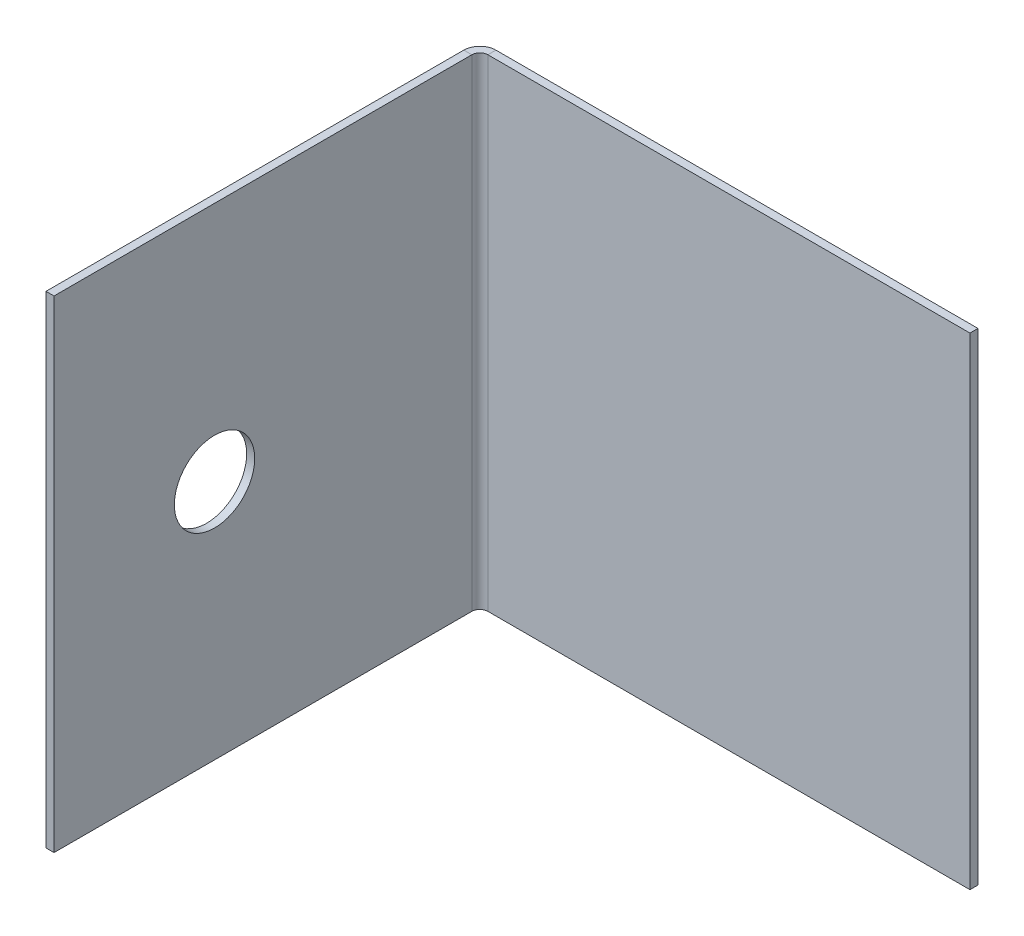
ISO-10303-21;
HEADER;
FILE_DESCRIPTION(('STEP AP214'),'2;1');
FILE_NAME('part.step','',(''),(''),'','','');
FILE_SCHEMA(('AUTOMOTIVE_DESIGN { 1 0 10303 214 1 1 1 1 }'));
ENDSEC;
DATA;
#1=APPLICATION_CONTEXT('core data for automotive mechanical design processes');
#2=APPLICATION_PROTOCOL_DEFINITION('international standard','automotive_design',2000,#1);
#3=PRODUCT_CONTEXT('',#1,'mechanical');
#4=PRODUCT('Part','Part','',(#3));
#5=PRODUCT_RELATED_PRODUCT_CATEGORY('part','',(#4));
#6=PRODUCT_DEFINITION_FORMATION('','',#4);
#7=PRODUCT_DEFINITION_CONTEXT('part definition',#1,'design');
#8=PRODUCT_DEFINITION('design','',#6,#7);
#9=PRODUCT_DEFINITION_SHAPE('','',#8);
#10=(LENGTH_UNIT() NAMED_UNIT(*) SI_UNIT(.MILLI.,.METRE.));
#11=(NAMED_UNIT(*) PLANE_ANGLE_UNIT() SI_UNIT($,.RADIAN.));
#12=(NAMED_UNIT(*) SI_UNIT($,.STERADIAN.) SOLID_ANGLE_UNIT());
#13=UNCERTAINTY_MEASURE_WITH_UNIT(LENGTH_MEASURE(1.E-05),#10,'distance_accuracy_value','');
#14=(GEOMETRIC_REPRESENTATION_CONTEXT(3) GLOBAL_UNCERTAINTY_ASSIGNED_CONTEXT((#13)) GLOBAL_UNIT_ASSIGNED_CONTEXT((#10,
#11,#12)) REPRESENTATION_CONTEXT('',''));
#15=CARTESIAN_POINT('',(0.,0.,0.));
#16=DIRECTION('',(0.,0.,1.));
#17=DIRECTION('',(1.,0.,0.));
#18=AXIS2_PLACEMENT_3D('',#15,#16,#17);
#19=CARTESIAN_POINT('',(15.,15.,-0.5));
#20=DIRECTION('',(1.,0.,0.));
#21=DIRECTION('',(0.,1.,0.));
#22=AXIS2_PLACEMENT_3D('',#19,#20,#21);
#23=PLANE('',#22);
#24=DIRECTION('',(0.,1.,0.));
#25=VECTOR('',#24,1.);
#26=CARTESIAN_POINT('',(15.,15.,0.));
#27=LINE('',#26,#25);
#28=CARTESIAN_POINT('',(15.,-15.,0.));
#29=VERTEX_POINT('',#28);
#30=CARTESIAN_POINT('',(15.,15.,0.));
#31=VERTEX_POINT('',#30);
#32=EDGE_CURVE('E177',#29,#31,#27,.T.);
#33=ORIENTED_EDGE('',*,*,#32,.F.);
#34=DIRECTION('',(0.,0.,1.));
#35=VECTOR('',#34,1.);
#36=CARTESIAN_POINT('',(15.,-15.,-0.5));
#37=LINE('',#36,#35);
#38=CARTESIAN_POINT('',(15.,-15.,-0.5));
#39=VERTEX_POINT('',#38);
#40=EDGE_CURVE('E13',#39,#29,#37,.T.);
#41=ORIENTED_EDGE('',*,*,#40,.F.);
#42=DIRECTION('',(0.,1.,0.));
#43=VECTOR('',#42,1.);
#44=CARTESIAN_POINT('',(15.,15.,-0.5));
#45=LINE('',#44,#43);
#46=CARTESIAN_POINT('',(15.,15.,-0.5));
#47=VERTEX_POINT('',#46);
#48=EDGE_CURVE('E187',#39,#47,#45,.T.);
#49=ORIENTED_EDGE('',*,*,#48,.T.);
#50=DIRECTION('',(0.,0.,1.));
#51=VECTOR('',#50,1.);
#52=CARTESIAN_POINT('',(15.,15.,-0.5));
#53=LINE('',#52,#51);
#54=EDGE_CURVE('E61',#47,#31,#53,.T.);
#55=ORIENTED_EDGE('',*,*,#54,.T.);
#56=EDGE_LOOP('',(#33,#41,#49,#55));
#57=FACE_BOUND('',#56,.T.);
#58=ADVANCED_FACE('F58',(#57),#23,.T.);
#59=CARTESIAN_POINT('',(-15.,-15.,-0.5));
#60=DIRECTION('',(0.,-1.,0.));
#61=DIRECTION('',(0.,0.,-1.));
#62=AXIS2_PLACEMENT_3D('',#59,#60,#61);
#63=PLANE('',#62);
#64=DIRECTION('',(1.,0.,0.));
#65=VECTOR('',#64,1.);
#66=CARTESIAN_POINT('',(-15.,-15.,0.));
#67=LINE('',#66,#65);
#68=CARTESIAN_POINT('',(-15.,-15.,0.));
#69=VERTEX_POINT('',#68);
#70=EDGE_CURVE('E190',#69,#29,#67,.T.);
#71=ORIENTED_EDGE('',*,*,#70,.F.);
#72=DIRECTION('',(0.,0.,1.));
#73=VECTOR('',#72,1.);
#74=CARTESIAN_POINT('',(-15.,-15.,-0.5));
#75=LINE('',#74,#73);
#76=CARTESIAN_POINT('',(-15.,-15.,-0.500000000000001));
#77=VERTEX_POINT('',#76);
#78=EDGE_CURVE('E67',#77,#69,#75,.T.);
#79=ORIENTED_EDGE('',*,*,#78,.F.);
#80=DIRECTION('',(1.,0.,0.));
#81=VECTOR('',#80,1.);
#82=CARTESIAN_POINT('',(-15.,-15.,-0.5));
#83=LINE('',#82,#81);
#84=EDGE_CURVE('E195',#77,#39,#83,.T.);
#85=ORIENTED_EDGE('',*,*,#84,.T.);
#86=ORIENTED_EDGE('',*,*,#40,.T.);
#87=EDGE_LOOP('',(#71,#79,#85,#86));
#88=FACE_BOUND('',#87,.T.);
#89=ADVANCED_FACE('F209',(#88),#63,.T.);
#90=CARTESIAN_POINT('',(-15.,15.,-0.5));
#91=DIRECTION('',(0.,1.,0.));
#92=DIRECTION('',(0.,0.,1.));
#93=AXIS2_PLACEMENT_3D('',#90,#91,#92);
#94=PLANE('',#93);
#95=DIRECTION('',(-1.,0.,0.));
#96=VECTOR('',#95,1.);
#97=CARTESIAN_POINT('',(-15.,15.,0.));
#98=LINE('',#97,#96);
#99=CARTESIAN_POINT('',(-15.,15.,0.));
#100=VERTEX_POINT('',#99);
#101=EDGE_CURVE('E199',#31,#100,#98,.T.);
#102=ORIENTED_EDGE('',*,*,#101,.F.);
#103=ORIENTED_EDGE('',*,*,#54,.F.);
#104=DIRECTION('',(-1.,0.,0.));
#105=VECTOR('',#104,1.);
#106=CARTESIAN_POINT('',(-15.,15.,-0.5));
#107=LINE('',#106,#105);
#108=CARTESIAN_POINT('',(-15.,15.,-0.5));
#109=VERTEX_POINT('',#108);
#110=EDGE_CURVE('E189',#47,#109,#107,.T.);
#111=ORIENTED_EDGE('',*,*,#110,.T.);
#112=DIRECTION('',(0.,0.,1.));
#113=VECTOR('',#112,1.);
#114=CARTESIAN_POINT('',(-15.,15.,-0.5));
#115=LINE('',#114,#113);
#116=EDGE_CURVE('E204',#109,#100,#115,.T.);
#117=ORIENTED_EDGE('',*,*,#116,.T.);
#118=EDGE_LOOP('',(#102,#103,#111,#117));
#119=FACE_BOUND('',#118,.T.);
#120=ADVANCED_FACE('F206',(#119),#94,.T.);
#121=CARTESIAN_POINT('',(0.,0.,-0.5));
#122=DIRECTION('',(0.,0.,1.));
#123=DIRECTION('',(1.,0.,0.));
#124=AXIS2_PLACEMENT_3D('',#121,#122,#123);
#125=PLANE('',#124);
#126=ORIENTED_EDGE('',*,*,#48,.F.);
#127=ORIENTED_EDGE('',*,*,#84,.F.);
#128=DIRECTION('',(0.,-1.,0.));
#129=VECTOR('',#128,1.);
#130=CARTESIAN_POINT('',(-15.,15.,-0.5));
#131=LINE('',#130,#129);
#132=EDGE_CURVE('E192',#109,#77,#131,.T.);
#133=ORIENTED_EDGE('',*,*,#132,.F.);
#134=ORIENTED_EDGE('',*,*,#110,.F.);
#135=EDGE_LOOP('',(#126,#127,#133,#134));
#136=FACE_BOUND('',#135,.T.);
#137=ADVANCED_FACE('F251',(#136),#125,.F.);
#138=CARTESIAN_POINT('',(0.,0.,0.));
#139=DIRECTION('',(0.,0.,1.));
#140=DIRECTION('',(1.,0.,0.));
#141=AXIS2_PLACEMENT_3D('',#138,#139,#140);
#142=PLANE('',#141);
#143=ORIENTED_EDGE('',*,*,#32,.T.);
#144=ORIENTED_EDGE('',*,*,#101,.T.);
#145=DIRECTION('',(0.,-1.,0.));
#146=VECTOR('',#145,1.);
#147=CARTESIAN_POINT('',(-15.,15.,0.));
#148=LINE('',#147,#146);
#149=EDGE_CURVE('E93',#100,#69,#148,.T.);
#150=ORIENTED_EDGE('',*,*,#149,.T.);
#151=ORIENTED_EDGE('',*,*,#70,.T.);
#152=EDGE_LOOP('',(#143,#144,#150,#151));
#153=FACE_BOUND('',#152,.T.);
#154=ADVANCED_FACE('F207',(#153),#142,.T.);
#155=CARTESIAN_POINT('',(-15.,15.,0.500000000000001));
#156=DIRECTION('',(0.,1.,0.));
#157=DIRECTION('',(0.,0.,1.));
#158=AXIS2_PLACEMENT_3D('',#155,#156,#157);
#159=PLANE('',#158);
#160=DIRECTION('',(1.,0.,0.));
#161=VECTOR('',#160,1.);
#162=CARTESIAN_POINT('',(-16.,15.,0.499999999999997));
#163=LINE('',#162,#161);
#164=CARTESIAN_POINT('',(-15.5,15.,0.5));
#165=VERTEX_POINT('',#164);
#166=CARTESIAN_POINT('',(-16.,15.,0.499999999999998));
#167=VERTEX_POINT('',#166);
#168=EDGE_CURVE('E155',#165,#167,#163,.F.);
#169=ORIENTED_EDGE('',*,*,#168,.F.);
#170=CARTESIAN_POINT('',(-15.,15.,0.500000000000001));
#171=DIRECTION('',(0.,-1.,0.));
#172=DIRECTION('',(0.,0.,-1.));
#173=AXIS2_PLACEMENT_3D('',#170,#171,#172);
#174=CIRCLE('',#173,0.500000000000002);
#175=EDGE_CURVE('E181',#100,#165,#174,.F.);
#176=ORIENTED_EDGE('',*,*,#175,.F.);
#177=ORIENTED_EDGE('',*,*,#116,.F.);
#178=CARTESIAN_POINT('',(-15.,15.,0.500000000000001));
#179=DIRECTION('',(0.,-1.,0.));
#180=DIRECTION('',(0.,0.,-1.));
#181=AXIS2_PLACEMENT_3D('',#178,#179,#180);
#182=CIRCLE('',#181,1.);
#183=EDGE_CURVE('E174',#109,#167,#182,.F.);
#184=ORIENTED_EDGE('',*,*,#183,.T.);
#185=EDGE_LOOP('',(#169,#176,#177,#184));
#186=FACE_BOUND('',#185,.T.);
#187=ADVANCED_FACE('F255',(#186),#159,.T.);
#188=CARTESIAN_POINT('',(-15.,-15.,0.500000000000001));
#189=DIRECTION('',(0.,1.,0.));
#190=DIRECTION('',(0.,0.,1.));
#191=AXIS2_PLACEMENT_3D('',#188,#189,#190);
#192=PLANE('',#191);
#193=CARTESIAN_POINT('',(-15.,-15.,0.500000000000001));
#194=DIRECTION('',(0.,-1.,0.));
#195=DIRECTION('',(0.,0.,-1.));
#196=AXIS2_PLACEMENT_3D('',#193,#194,#195);
#197=CIRCLE('',#196,0.500000000000002);
#198=CARTESIAN_POINT('',(-15.5,-15.,0.5));
#199=VERTEX_POINT('',#198);
#200=EDGE_CURVE('E184',#199,#69,#197,.T.);
#201=ORIENTED_EDGE('',*,*,#200,.F.);
#202=DIRECTION('',(1.,0.,0.));
#203=VECTOR('',#202,1.);
#204=CARTESIAN_POINT('',(-15.5,-15.,0.5));
#205=LINE('',#204,#203);
#206=CARTESIAN_POINT('',(-16.,-15.,0.499999999999999));
#207=VERTEX_POINT('',#206);
#208=EDGE_CURVE('E167',#199,#207,#205,.F.);
#209=ORIENTED_EDGE('',*,*,#208,.T.);
#210=CARTESIAN_POINT('',(-15.,-15.,0.500000000000001));
#211=DIRECTION('',(0.,-1.,0.));
#212=DIRECTION('',(0.,0.,-1.));
#213=AXIS2_PLACEMENT_3D('',#210,#211,#212);
#214=CIRCLE('',#213,1.);
#215=EDGE_CURVE('E178',#207,#77,#214,.T.);
#216=ORIENTED_EDGE('',*,*,#215,.T.);
#217=ORIENTED_EDGE('',*,*,#78,.T.);
#218=EDGE_LOOP('',(#201,#209,#216,#217));
#219=FACE_BOUND('',#218,.T.);
#220=ADVANCED_FACE('F212',(#219),#192,.F.);
#221=CARTESIAN_POINT('',(-15.,-15.,0.500000000000001));
#222=DIRECTION('',(0.,-1.,0.));
#223=DIRECTION('',(-1.,0.,0.));
#224=AXIS2_PLACEMENT_3D('',#221,#222,#223);
#225=CYLINDRICAL_SURFACE('',#224,1.);
#226=ORIENTED_EDGE('',*,*,#132,.T.);
#227=ORIENTED_EDGE('',*,*,#215,.F.);
#228=DIRECTION('',(0.,-1.,0.));
#229=VECTOR('',#228,1.);
#230=CARTESIAN_POINT('',(-16.,15.,0.499999999999997));
#231=LINE('',#230,#229);
#232=EDGE_CURVE('E165',#207,#167,#231,.F.);
#233=ORIENTED_EDGE('',*,*,#232,.T.);
#234=ORIENTED_EDGE('',*,*,#183,.F.);
#235=EDGE_LOOP('',(#226,#227,#233,#234));
#236=FACE_BOUND('',#235,.T.);
#237=ADVANCED_FACE('F261',(#236),#225,.T.);
#238=CARTESIAN_POINT('',(-15.,-15.,0.500000000000001));
#239=DIRECTION('',(0.,-1.,0.));
#240=DIRECTION('',(-1.,0.,0.));
#241=AXIS2_PLACEMENT_3D('',#238,#239,#240);
#242=CYLINDRICAL_SURFACE('',#241,0.500000000000002);
#243=ORIENTED_EDGE('',*,*,#149,.F.);
#244=ORIENTED_EDGE('',*,*,#175,.T.);
#245=DIRECTION('',(0.,-1.,0.));
#246=VECTOR('',#245,1.);
#247=CARTESIAN_POINT('',(-15.5,15.,0.499999999999999));
#248=LINE('',#247,#246);
#249=EDGE_CURVE('E170',#165,#199,#248,.T.);
#250=ORIENTED_EDGE('',*,*,#249,.T.);
#251=ORIENTED_EDGE('',*,*,#200,.T.);
#252=EDGE_LOOP('',(#243,#244,#250,#251));
#253=FACE_BOUND('',#252,.T.);
#254=ADVANCED_FACE('F215',(#253),#242,.F.);
#255=CARTESIAN_POINT('',(-16.0000000000001,-15.,26.5));
#256=DIRECTION('',(0.,1.,0.));
#257=DIRECTION('',(-1.,0.,0.));
#258=AXIS2_PLACEMENT_3D('',#255,#256,#257);
#259=PLANE('',#258);
#260=ORIENTED_EDGE('',*,*,#208,.F.);
#261=DIRECTION('',(0.,0.,-1.));
#262=VECTOR('',#261,1.);
#263=CARTESIAN_POINT('',(-15.5000000000001,-15.,26.5));
#264=LINE('',#263,#262);
#265=CARTESIAN_POINT('',(-15.5000000000001,-15.,26.5));
#266=VERTEX_POINT('',#265);
#267=EDGE_CURVE('E163',#199,#266,#264,.F.);
#268=ORIENTED_EDGE('',*,*,#267,.T.);
#269=DIRECTION('',(1.,0.,0.));
#270=VECTOR('',#269,1.);
#271=CARTESIAN_POINT('',(-16.0000000000001,-15.,26.5));
#272=LINE('',#271,#270);
#273=CARTESIAN_POINT('',(-16.0000000000001,-15.,26.5));
#274=VERTEX_POINT('',#273);
#275=EDGE_CURVE('E151',#274,#266,#272,.T.);
#276=ORIENTED_EDGE('',*,*,#275,.F.);
#277=DIRECTION('',(0.,0.,1.));
#278=VECTOR('',#277,1.);
#279=CARTESIAN_POINT('',(-16.,-15.,0.));
#280=LINE('',#279,#278);
#281=EDGE_CURVE('E138',#207,#274,#280,.T.);
#282=ORIENTED_EDGE('',*,*,#281,.F.);
#283=EDGE_LOOP('',(#260,#268,#276,#282));
#284=FACE_BOUND('',#283,.T.);
#285=ADVANCED_FACE('F222',(#284),#259,.F.);
#286=CARTESIAN_POINT('',(-16.,15.,0.));
#287=DIRECTION('',(0.,-1.,0.));
#288=DIRECTION('',(1.,0.,0.));
#289=AXIS2_PLACEMENT_3D('',#286,#287,#288);
#290=PLANE('',#289);
#291=ORIENTED_EDGE('',*,*,#168,.T.);
#292=DIRECTION('',(0.,0.,-1.));
#293=VECTOR('',#292,1.);
#294=CARTESIAN_POINT('',(-16.,15.,0.));
#295=LINE('',#294,#293);
#296=CARTESIAN_POINT('',(-16.0000000000001,15.,26.5));
#297=VERTEX_POINT('',#296);
#298=EDGE_CURVE('E136',#297,#167,#295,.T.);
#299=ORIENTED_EDGE('',*,*,#298,.F.);
#300=DIRECTION('',(1.,0.,0.));
#301=VECTOR('',#300,1.);
#302=CARTESIAN_POINT('',(-16.0000000000001,15.,26.5));
#303=LINE('',#302,#301);
#304=CARTESIAN_POINT('',(-15.5000000000001,15.,26.5));
#305=VERTEX_POINT('',#304);
#306=EDGE_CURVE('E144',#297,#305,#303,.T.);
#307=ORIENTED_EDGE('',*,*,#306,.T.);
#308=DIRECTION('',(0.,0.,1.));
#309=VECTOR('',#308,1.);
#310=CARTESIAN_POINT('',(-15.5,15.,0.));
#311=LINE('',#310,#309);
#312=EDGE_CURVE('E160',#305,#165,#311,.F.);
#313=ORIENTED_EDGE('',*,*,#312,.T.);
#314=EDGE_LOOP('',(#291,#299,#307,#313));
#315=FACE_BOUND('',#314,.T.);
#316=ADVANCED_FACE('F154',(#315),#290,.F.);
#317=CARTESIAN_POINT('',(-16.,0.,0.));
#318=DIRECTION('',(1.,0.,0.));
#319=DIRECTION('',(0.,0.,-1.));
#320=AXIS2_PLACEMENT_3D('',#317,#318,#319);
#321=PLANE('',#320);
#322=CARTESIAN_POINT('',(-16.,0.,16.5125078222809));
#323=DIRECTION('',(1.,0.,0.));
#324=DIRECTION('',(0.,0.,-1.));
#325=AXIS2_PLACEMENT_3D('',#322,#323,#324);
#326=CIRCLE('',#325,2.5);
#327=CARTESIAN_POINT('',(-16.,0.,14.0125078222809));
#328=VERTEX_POINT('',#327);
#329=EDGE_CURVE('E173',#328,#328,#326,.T.);
#330=ORIENTED_EDGE('',*,*,#329,.T.);
#331=EDGE_LOOP('',(#330));
#332=FACE_BOUND('',#331,.T.);
#333=ORIENTED_EDGE('',*,*,#232,.F.);
#334=ORIENTED_EDGE('',*,*,#281,.T.);
#335=DIRECTION('',(0.,1.,0.));
#336=VECTOR('',#335,1.);
#337=CARTESIAN_POINT('',(-16.0000000000001,0.,26.5));
#338=LINE('',#337,#336);
#339=EDGE_CURVE('E131',#274,#297,#338,.T.);
#340=ORIENTED_EDGE('',*,*,#339,.T.);
#341=ORIENTED_EDGE('',*,*,#298,.T.);
#342=EDGE_LOOP('',(#333,#334,#340,#341));
#343=FACE_BOUND('',#342,.T.);
#344=ADVANCED_FACE('F134',(#332,#343),#321,.F.);
#345=CARTESIAN_POINT('',(-15.5,0.,0.));
#346=DIRECTION('',(1.,0.,0.));
#347=DIRECTION('',(0.,0.,-1.));
#348=AXIS2_PLACEMENT_3D('',#345,#346,#347);
#349=PLANE('',#348);
#350=CARTESIAN_POINT('',(-15.5,0.,16.5125078222809));
#351=DIRECTION('',(1.,0.,0.));
#352=DIRECTION('',(0.,0.,-1.));
#353=AXIS2_PLACEMENT_3D('',#350,#351,#352);
#354=CIRCLE('',#353,2.5);
#355=CARTESIAN_POINT('',(-15.5,0.,14.0125078222809));
#356=VERTEX_POINT('',#355);
#357=EDGE_CURVE('E226',#356,#356,#354,.T.);
#358=ORIENTED_EDGE('',*,*,#357,.F.);
#359=EDGE_LOOP('',(#358));
#360=FACE_BOUND('',#359,.T.);
#361=ORIENTED_EDGE('',*,*,#267,.F.);
#362=ORIENTED_EDGE('',*,*,#249,.F.);
#363=ORIENTED_EDGE('',*,*,#312,.F.);
#364=DIRECTION('',(0.,-1.,0.));
#365=VECTOR('',#364,1.);
#366=CARTESIAN_POINT('',(-15.5000000000001,15.,26.5));
#367=LINE('',#366,#365);
#368=EDGE_CURVE('E147',#266,#305,#367,.F.);
#369=ORIENTED_EDGE('',*,*,#368,.F.);
#370=EDGE_LOOP('',(#361,#362,#363,#369));
#371=FACE_BOUND('',#370,.T.);
#372=ADVANCED_FACE('F220',(#360,#371),#349,.T.);
#373=CARTESIAN_POINT('',(-16.0000000000001,15.,26.5));
#374=DIRECTION('',(0.,0.,-1.));
#375=DIRECTION('',(-1.,0.,0.));
#376=AXIS2_PLACEMENT_3D('',#373,#374,#375);
#377=PLANE('',#376);
#378=ORIENTED_EDGE('',*,*,#368,.T.);
#379=ORIENTED_EDGE('',*,*,#306,.F.);
#380=ORIENTED_EDGE('',*,*,#339,.F.);
#381=ORIENTED_EDGE('',*,*,#275,.T.);
#382=EDGE_LOOP('',(#378,#379,#380,#381));
#383=FACE_BOUND('',#382,.T.);
#384=ADVANCED_FACE('F145',(#383),#377,.F.);
#385=CARTESIAN_POINT('',(-15.5,0.,16.5125078222809));
#386=DIRECTION('',(1.,0.,0.));
#387=DIRECTION('',(0.,0.,-1.));
#388=AXIS2_PLACEMENT_3D('',#385,#386,#387);
#389=CYLINDRICAL_SURFACE('',#388,2.5);
#390=ORIENTED_EDGE('',*,*,#357,.T.);
#391=EDGE_LOOP('',(#390));
#392=FACE_BOUND('',#391,.T.);
#393=ORIENTED_EDGE('',*,*,#329,.F.);
#394=EDGE_LOOP('',(#393));
#395=FACE_BOUND('',#394,.T.);
#396=ADVANCED_FACE('F230',(#392,#395),#389,.F.);
#397=CLOSED_SHELL('',(#58,#89,#120,#137,#154,#187,#220,#237,#254,#285,#316,#344,#372,#384,#396));
#398=MANIFOLD_SOLID_BREP('B2',#397);
#399=ADVANCED_BREP_SHAPE_REPRESENTATION('',(#18,#398),#14);
#400=SHAPE_DEFINITION_REPRESENTATION(#9,#399);
ENDSEC;
END-ISO-10303-21;
